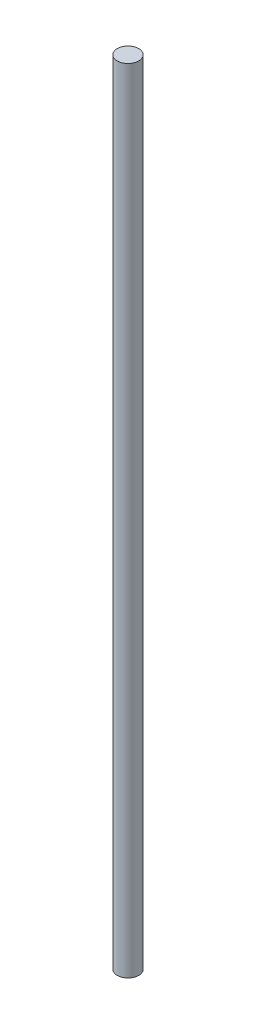
ISO-10303-21;
HEADER;
FILE_DESCRIPTION(('STEP AP214'),'2;1');
FILE_NAME('part.step','',(''),(''),'','','');
FILE_SCHEMA(('AUTOMOTIVE_DESIGN { 1 0 10303 214 1 1 1 1 }'));
ENDSEC;
DATA;
#1=APPLICATION_CONTEXT('core data for automotive mechanical design processes');
#2=APPLICATION_PROTOCOL_DEFINITION('international standard','automotive_design',2000,#1);
#3=PRODUCT_CONTEXT('',#1,'mechanical');
#4=PRODUCT('Part','Part','',(#3));
#5=PRODUCT_RELATED_PRODUCT_CATEGORY('part','',(#4));
#6=PRODUCT_DEFINITION_FORMATION('','',#4);
#7=PRODUCT_DEFINITION_CONTEXT('part definition',#1,'design');
#8=PRODUCT_DEFINITION('design','',#6,#7);
#9=PRODUCT_DEFINITION_SHAPE('','',#8);
#10=(LENGTH_UNIT() NAMED_UNIT(*) SI_UNIT(.MILLI.,.METRE.));
#11=(NAMED_UNIT(*) PLANE_ANGLE_UNIT() SI_UNIT($,.RADIAN.));
#12=(NAMED_UNIT(*) SI_UNIT($,.STERADIAN.) SOLID_ANGLE_UNIT());
#13=UNCERTAINTY_MEASURE_WITH_UNIT(LENGTH_MEASURE(1.E-05),#10,'distance_accuracy_value','');
#14=(GEOMETRIC_REPRESENTATION_CONTEXT(3) GLOBAL_UNCERTAINTY_ASSIGNED_CONTEXT((#13)) GLOBAL_UNIT_ASSIGNED_CONTEXT((#10,
#11,#12)) REPRESENTATION_CONTEXT('',''));
#15=CARTESIAN_POINT('',(0.,0.,0.));
#16=DIRECTION('',(0.,0.,1.));
#17=DIRECTION('',(1.,0.,0.));
#18=AXIS2_PLACEMENT_3D('',#15,#16,#17);
#19=CARTESIAN_POINT('',(0.,295.,0.));
#20=DIRECTION('',(0.,-1.,0.));
#21=DIRECTION('',(0.,0.,-1.));
#22=AXIS2_PLACEMENT_3D('',#19,#20,#21);
#23=CYLINDRICAL_SURFACE('',#22,4.);
#24=CARTESIAN_POINT('',(0.,295.,0.));
#25=DIRECTION('',(0.,1.,0.));
#26=DIRECTION('',(0.,0.,1.));
#27=AXIS2_PLACEMENT_3D('',#24,#25,#26);
#28=CIRCLE('',#27,4.);
#29=CARTESIAN_POINT('',(0.,295.,4.));
#30=VERTEX_POINT('',#29);
#31=EDGE_CURVE('E10',#30,#30,#28,.T.);
#32=ORIENTED_EDGE('',*,*,#31,.F.);
#33=EDGE_LOOP('',(#32));
#34=FACE_BOUND('',#33,.T.);
#35=CARTESIAN_POINT('',(0.,0.,0.));
#36=DIRECTION('',(0.,1.,0.));
#37=DIRECTION('',(0.,0.,1.));
#38=AXIS2_PLACEMENT_3D('',#35,#36,#37);
#39=CIRCLE('',#38,4.);
#40=CARTESIAN_POINT('',(0.,0.,4.));
#41=VERTEX_POINT('',#40);
#42=EDGE_CURVE('E33',#41,#41,#39,.T.);
#43=ORIENTED_EDGE('',*,*,#42,.T.);
#44=EDGE_LOOP('',(#43));
#45=FACE_BOUND('',#44,.T.);
#46=ADVANCED_FACE('F30',(#34,#45),#23,.T.);
#47=CARTESIAN_POINT('',(0.,295.,0.));
#48=DIRECTION('',(0.,1.,0.));
#49=DIRECTION('',(0.,0.,1.));
#50=AXIS2_PLACEMENT_3D('',#47,#48,#49);
#51=PLANE('',#50);
#52=ORIENTED_EDGE('',*,*,#31,.T.);
#53=EDGE_LOOP('',(#52));
#54=FACE_BOUND('',#53,.T.);
#55=ADVANCED_FACE('F45',(#54),#51,.T.);
#56=CARTESIAN_POINT('',(0.,0.,0.));
#57=DIRECTION('',(0.,1.,0.));
#58=DIRECTION('',(0.,0.,1.));
#59=AXIS2_PLACEMENT_3D('',#56,#57,#58);
#60=PLANE('',#59);
#61=ORIENTED_EDGE('',*,*,#42,.F.);
#62=EDGE_LOOP('',(#61));
#63=FACE_BOUND('',#62,.T.);
#64=ADVANCED_FACE('F43',(#63),#60,.F.);
#65=CLOSED_SHELL('',(#46,#55,#64));
#66=MANIFOLD_SOLID_BREP('B2',#65);
#67=ADVANCED_BREP_SHAPE_REPRESENTATION('',(#18,#66),#14);
#68=SHAPE_DEFINITION_REPRESENTATION(#9,#67);
ENDSEC;
END-ISO-10303-21;
